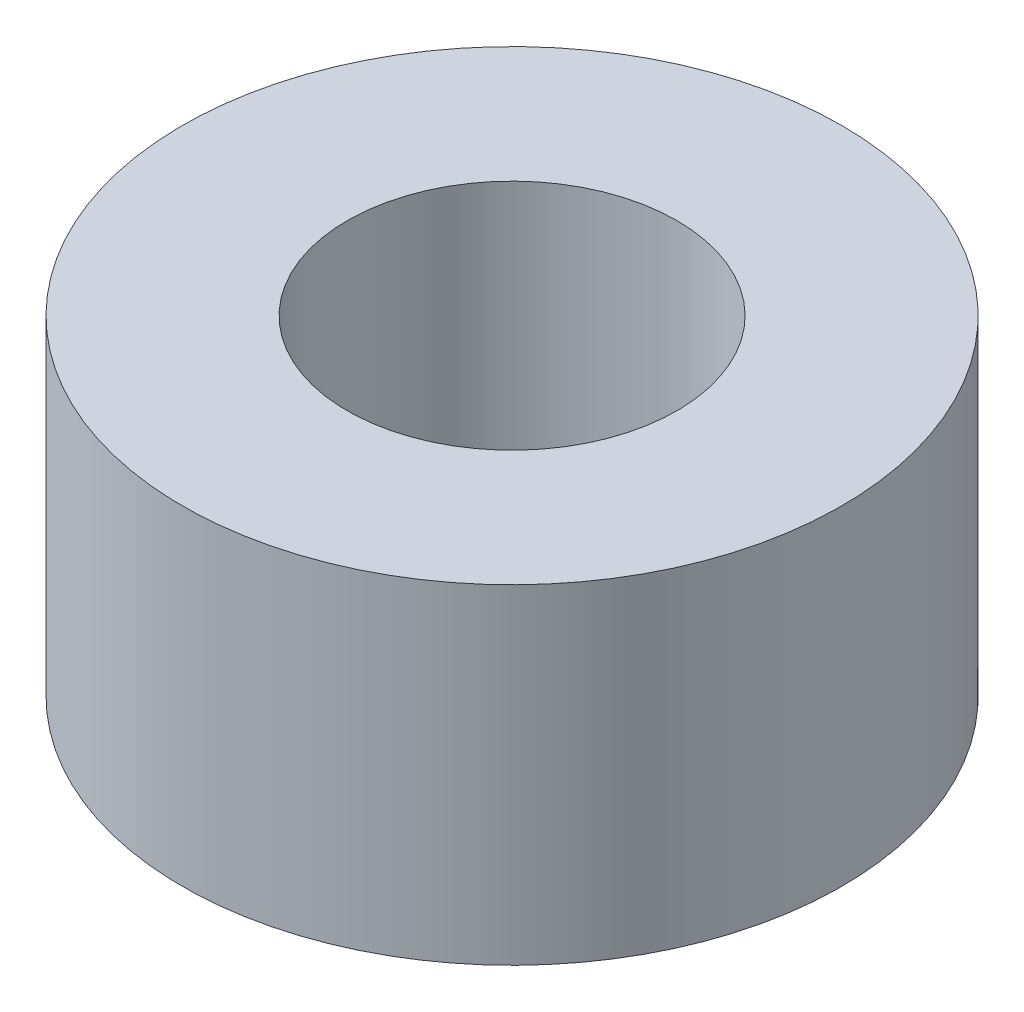
ISO-10303-21;
HEADER;
FILE_DESCRIPTION(('STEP AP214'),'2;1');
FILE_NAME('part.step','',(''),(''),'','','');
FILE_SCHEMA(('AUTOMOTIVE_DESIGN { 1 0 10303 214 1 1 1 1 }'));
ENDSEC;
DATA;
#1=APPLICATION_CONTEXT('core data for automotive mechanical design processes');
#2=APPLICATION_PROTOCOL_DEFINITION('international standard','automotive_design',2000,#1);
#3=PRODUCT_CONTEXT('',#1,'mechanical');
#4=PRODUCT('Part','Part','',(#3));
#5=PRODUCT_RELATED_PRODUCT_CATEGORY('part','',(#4));
#6=PRODUCT_DEFINITION_FORMATION('','',#4);
#7=PRODUCT_DEFINITION_CONTEXT('part definition',#1,'design');
#8=PRODUCT_DEFINITION('design','',#6,#7);
#9=PRODUCT_DEFINITION_SHAPE('','',#8);
#10=(LENGTH_UNIT() NAMED_UNIT(*) SI_UNIT(.MILLI.,.METRE.));
#11=(NAMED_UNIT(*) PLANE_ANGLE_UNIT() SI_UNIT($,.RADIAN.));
#12=(NAMED_UNIT(*) SI_UNIT($,.STERADIAN.) SOLID_ANGLE_UNIT());
#13=UNCERTAINTY_MEASURE_WITH_UNIT(LENGTH_MEASURE(1.E-05),#10,'distance_accuracy_value','');
#14=(GEOMETRIC_REPRESENTATION_CONTEXT(3) GLOBAL_UNCERTAINTY_ASSIGNED_CONTEXT((#13)) GLOBAL_UNIT_ASSIGNED_CONTEXT((#10,
#11,#12)) REPRESENTATION_CONTEXT('',''));
#15=CARTESIAN_POINT('',(0.,0.,0.));
#16=DIRECTION('',(0.,0.,1.));
#17=DIRECTION('',(1.,0.,0.));
#18=AXIS2_PLACEMENT_3D('',#15,#16,#17);
#19=CARTESIAN_POINT('',(0.,0.,0.));
#20=DIRECTION('',(0.,-1.,0.));
#21=DIRECTION('',(0.,0.,-1.));
#22=AXIS2_PLACEMENT_3D('',#19,#20,#21);
#23=CYLINDRICAL_SURFACE('',#22,2.);
#24=CARTESIAN_POINT('',(0.,0.,0.));
#25=DIRECTION('',(0.,-1.,0.));
#26=DIRECTION('',(0.,0.,-1.));
#27=AXIS2_PLACEMENT_3D('',#24,#25,#26);
#28=CIRCLE('',#27,2.);
#29=CARTESIAN_POINT('',(0.,0.,-2.));
#30=VERTEX_POINT('',#29);
#31=EDGE_CURVE('E26',#30,#30,#28,.T.);
#32=ORIENTED_EDGE('',*,*,#31,.F.);
#33=EDGE_LOOP('',(#32));
#34=FACE_BOUND('',#33,.T.);
#35=CARTESIAN_POINT('',(0.,2.,0.));
#36=DIRECTION('',(0.,-1.,0.));
#37=DIRECTION('',(0.,0.,-1.));
#38=AXIS2_PLACEMENT_3D('',#35,#36,#37);
#39=CIRCLE('',#38,2.);
#40=CARTESIAN_POINT('',(0.,2.,-2.));
#41=VERTEX_POINT('',#40);
#42=EDGE_CURVE('E17',#41,#41,#39,.F.);
#43=ORIENTED_EDGE('',*,*,#42,.F.);
#44=EDGE_LOOP('',(#43));
#45=FACE_BOUND('',#44,.T.);
#46=ADVANCED_FACE('F14',(#34,#45),#23,.T.);
#47=CARTESIAN_POINT('',(0.,2.,0.));
#48=DIRECTION('',(0.,1.,0.));
#49=DIRECTION('',(0.,0.,1.));
#50=AXIS2_PLACEMENT_3D('',#47,#48,#49);
#51=PLANE('',#50);
#52=CARTESIAN_POINT('',(0.,2.,0.));
#53=DIRECTION('',(0.,-1.,0.));
#54=DIRECTION('',(0.,0.,-1.));
#55=AXIS2_PLACEMENT_3D('',#52,#53,#54);
#56=CIRCLE('',#55,1.);
#57=CARTESIAN_POINT('',(0.,2.,-1.));
#58=VERTEX_POINT('',#57);
#59=EDGE_CURVE('E21',#58,#58,#56,.F.);
#60=ORIENTED_EDGE('',*,*,#59,.F.);
#61=EDGE_LOOP('',(#60));
#62=FACE_BOUND('',#61,.T.);
#63=ORIENTED_EDGE('',*,*,#42,.T.);
#64=EDGE_LOOP('',(#63));
#65=FACE_BOUND('',#64,.T.);
#66=ADVANCED_FACE('F34',(#62,#65),#51,.T.);
#67=CARTESIAN_POINT('',(0.,0.,0.));
#68=DIRECTION('',(0.,1.,0.));
#69=DIRECTION('',(0.,0.,1.));
#70=AXIS2_PLACEMENT_3D('',#67,#68,#69);
#71=PLANE('',#70);
#72=CARTESIAN_POINT('',(0.,0.,0.));
#73=DIRECTION('',(0.,-1.,0.));
#74=DIRECTION('',(0.,0.,-1.));
#75=AXIS2_PLACEMENT_3D('',#72,#73,#74);
#76=CIRCLE('',#75,1.);
#77=CARTESIAN_POINT('',(0.,0.,-1.));
#78=VERTEX_POINT('',#77);
#79=EDGE_CURVE('E10',#78,#78,#76,.T.);
#80=ORIENTED_EDGE('',*,*,#79,.F.);
#81=EDGE_LOOP('',(#80));
#82=FACE_BOUND('',#81,.T.);
#83=ORIENTED_EDGE('',*,*,#31,.T.);
#84=EDGE_LOOP('',(#83));
#85=FACE_BOUND('',#84,.T.);
#86=ADVANCED_FACE('F42',(#82,#85),#71,.F.);
#87=CARTESIAN_POINT('',(0.,2.,0.));
#88=DIRECTION('',(0.,-1.,0.));
#89=DIRECTION('',(0.,0.,-1.));
#90=AXIS2_PLACEMENT_3D('',#87,#88,#89);
#91=CYLINDRICAL_SURFACE('',#90,1.);
#92=ORIENTED_EDGE('',*,*,#79,.T.);
#93=EDGE_LOOP('',(#92));
#94=FACE_BOUND('',#93,.T.);
#95=ORIENTED_EDGE('',*,*,#59,.T.);
#96=EDGE_LOOP('',(#95));
#97=FACE_BOUND('',#96,.T.);
#98=ADVANCED_FACE('F44',(#94,#97),#91,.F.);
#99=CLOSED_SHELL('',(#46,#66,#86,#98));
#100=MANIFOLD_SOLID_BREP('B1',#99);
#101=ADVANCED_BREP_SHAPE_REPRESENTATION('',(#18,#100),#14);
#102=SHAPE_DEFINITION_REPRESENTATION(#9,#101);
ENDSEC;
END-ISO-10303-21;
